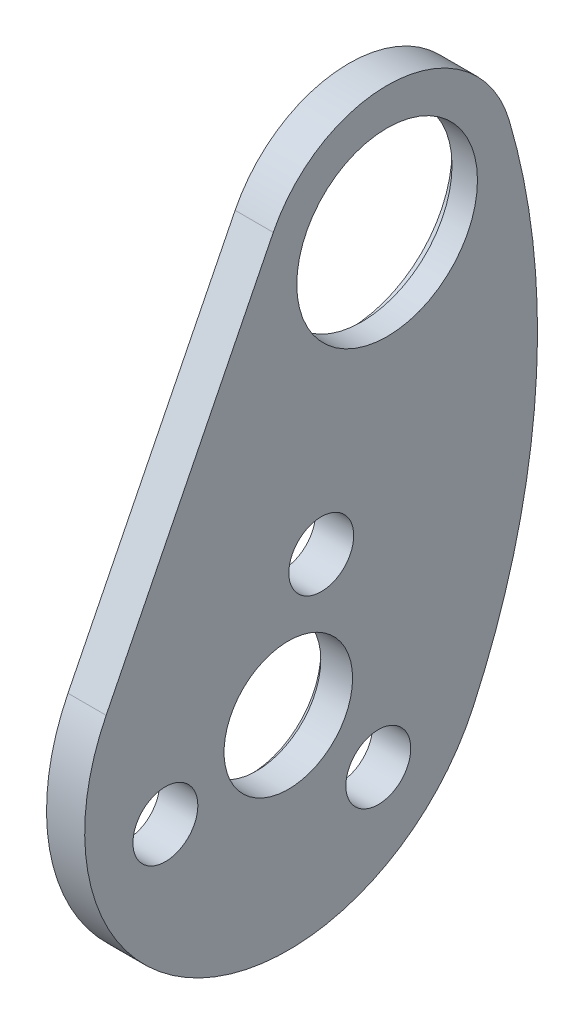
ISO-10303-21;
HEADER;
FILE_DESCRIPTION(('STEP AP214'),'2;1');
FILE_NAME('part.step','',(''),(''),'','','');
FILE_SCHEMA(('AUTOMOTIVE_DESIGN { 1 0 10303 214 1 1 1 1 }'));
ENDSEC;
DATA;
#1=APPLICATION_CONTEXT('core data for automotive mechanical design processes');
#2=APPLICATION_PROTOCOL_DEFINITION('international standard','automotive_design',2000,#1);
#3=PRODUCT_CONTEXT('',#1,'mechanical');
#4=PRODUCT('Part','Part','',(#3));
#5=PRODUCT_RELATED_PRODUCT_CATEGORY('part','',(#4));
#6=PRODUCT_DEFINITION_FORMATION('','',#4);
#7=PRODUCT_DEFINITION_CONTEXT('part definition',#1,'design');
#8=PRODUCT_DEFINITION('design','',#6,#7);
#9=PRODUCT_DEFINITION_SHAPE('','',#8);
#10=(LENGTH_UNIT() NAMED_UNIT(*) SI_UNIT(.MILLI.,.METRE.));
#11=(NAMED_UNIT(*) PLANE_ANGLE_UNIT() SI_UNIT($,.RADIAN.));
#12=(NAMED_UNIT(*) SI_UNIT($,.STERADIAN.) SOLID_ANGLE_UNIT());
#13=UNCERTAINTY_MEASURE_WITH_UNIT(LENGTH_MEASURE(1.E-05),#10,'distance_accuracy_value','');
#14=(GEOMETRIC_REPRESENTATION_CONTEXT(3) GLOBAL_UNCERTAINTY_ASSIGNED_CONTEXT((#13)) GLOBAL_UNIT_ASSIGNED_CONTEXT((#10,
#11,#12)) REPRESENTATION_CONTEXT('',''));
#15=CARTESIAN_POINT('',(0.,0.,0.));
#16=DIRECTION('',(0.,0.,1.));
#17=DIRECTION('',(1.,0.,0.));
#18=AXIS2_PLACEMENT_3D('',#15,#16,#17);
#19=CARTESIAN_POINT('',(10.,0.,0.));
#20=DIRECTION('',(-1.,0.,0.));
#21=DIRECTION('',(0.,0.,1.));
#22=AXIS2_PLACEMENT_3D('',#19,#20,#21);
#23=CYLINDRICAL_SURFACE('',#22,7.1);
#24=CARTESIAN_POINT('',(3.,0.,0.));
#25=DIRECTION('',(1.,0.,0.));
#26=DIRECTION('',(0.,0.,-1.));
#27=AXIS2_PLACEMENT_3D('',#24,#25,#26);
#28=CIRCLE('',#27,7.1);
#29=CARTESIAN_POINT('',(3.,0.,-7.1));
#30=VERTEX_POINT('',#29);
#31=EDGE_CURVE('E109',#30,#30,#28,.T.);
#32=ORIENTED_EDGE('',*,*,#31,.T.);
#33=EDGE_LOOP('',(#32));
#34=FACE_BOUND('',#33,.T.);
#35=CARTESIAN_POINT('',(0.999999999999999,0.,0.));
#36=DIRECTION('',(-1.,0.,0.));
#37=DIRECTION('',(0.,0.,1.));
#38=AXIS2_PLACEMENT_3D('',#35,#36,#37);
#39=CIRCLE('',#38,7.1);
#40=CARTESIAN_POINT('',(0.999999999999999,0.,7.1));
#41=VERTEX_POINT('',#40);
#42=EDGE_CURVE('E41',#41,#41,#39,.F.);
#43=ORIENTED_EDGE('',*,*,#42,.F.);
#44=EDGE_LOOP('',(#43));
#45=FACE_BOUND('',#44,.T.);
#46=ADVANCED_FACE('F37',(#34,#45),#23,.F.);
#47=CARTESIAN_POINT('',(3.,-12.6543120235321,43.1841219340059));
#48=DIRECTION('',(-1.,0.,0.));
#49=DIRECTION('',(0.,0.,1.));
#50=AXIS2_PLACEMENT_3D('',#47,#48,#49);
#51=CYLINDRICAL_SURFACE('',#50,55.);
#52=CARTESIAN_POINT('',(0.,-12.6543120235321,43.1841219340059));
#53=DIRECTION('',(1.,0.,0.));
#54=DIRECTION('',(0.,0.,-1.));
#55=AXIS2_PLACEMENT_3D('',#52,#53,#54);
#56=CIRCLE('',#55,55.);
#57=CARTESIAN_POINT('',(0.,-35.6745800256526,-6.76652632115234));
#58=VERTEX_POINT('',#57);
#59=CARTESIAN_POINT('',(0.,2.81206933856268,-9.59647154089021));
#60=VERTEX_POINT('',#59);
#61=EDGE_CURVE('E106',#58,#60,#56,.T.);
#62=ORIENTED_EDGE('',*,*,#61,.T.);
#63=DIRECTION('',(-1.,0.,0.));
#64=VECTOR('',#63,1.);
#65=CARTESIAN_POINT('',(3.,2.81206933856268,-9.59647154089021));
#66=LINE('',#65,#64);
#67=CARTESIAN_POINT('',(3.,2.81206933856268,-9.59647154089021));
#68=VERTEX_POINT('',#67);
#69=EDGE_CURVE('E97',#68,#60,#66,.T.);
#70=ORIENTED_EDGE('',*,*,#69,.F.);
#71=CARTESIAN_POINT('',(3.,-12.6543120235321,43.1841219340059));
#72=DIRECTION('',(1.,0.,0.));
#73=DIRECTION('',(0.,0.,-1.));
#74=AXIS2_PLACEMENT_3D('',#71,#72,#73);
#75=CIRCLE('',#74,55.);
#76=CARTESIAN_POINT('',(3.,-35.6745800256526,-6.76652632115234));
#77=VERTEX_POINT('',#76);
#78=EDGE_CURVE('E91',#77,#68,#75,.T.);
#79=ORIENTED_EDGE('',*,*,#78,.F.);
#80=DIRECTION('',(-1.,0.,0.));
#81=VECTOR('',#80,1.);
#82=CARTESIAN_POINT('',(3.,-35.6745800256526,-6.76652632115234));
#83=LINE('',#82,#81);
#84=EDGE_CURVE('E102',#77,#58,#83,.T.);
#85=ORIENTED_EDGE('',*,*,#84,.T.);
#86=EDGE_LOOP('',(#62,#70,#79,#85));
#87=FACE_BOUND('',#86,.T.);
#88=ADVANCED_FACE('F138',(#87),#51,.T.);
#89=CARTESIAN_POINT('',(3.,0.,0.));
#90=DIRECTION('',(-1.,0.,0.));
#91=DIRECTION('',(0.,0.,1.));
#92=AXIS2_PLACEMENT_3D('',#89,#90,#91);
#93=CYLINDRICAL_SURFACE('',#92,10.);
#94=CARTESIAN_POINT('',(0.,0.,0.));
#95=DIRECTION('',(1.,0.,0.));
#96=DIRECTION('',(0.,0.,-1.));
#97=AXIS2_PLACEMENT_3D('',#94,#95,#96);
#98=CIRCLE('',#97,10.);
#99=CARTESIAN_POINT('',(0.,4.46775003744035,8.94646352493273));
#100=VERTEX_POINT('',#99);
#101=EDGE_CURVE('E96',#60,#100,#98,.T.);
#102=ORIENTED_EDGE('',*,*,#101,.T.);
#103=DIRECTION('',(-1.,0.,0.));
#104=VECTOR('',#103,1.);
#105=CARTESIAN_POINT('',(3.,4.46775003744035,8.94646352493273));
#106=LINE('',#105,#104);
#107=CARTESIAN_POINT('',(3.,4.46775003744035,8.94646352493273));
#108=VERTEX_POINT('',#107);
#109=EDGE_CURVE('E94',#108,#100,#106,.T.);
#110=ORIENTED_EDGE('',*,*,#109,.F.);
#111=CARTESIAN_POINT('',(3.,0.,0.));
#112=DIRECTION('',(1.,0.,0.));
#113=DIRECTION('',(0.,0.,-1.));
#114=AXIS2_PLACEMENT_3D('',#111,#112,#113);
#115=CIRCLE('',#114,10.);
#116=EDGE_CURVE('E86',#68,#108,#115,.T.);
#117=ORIENTED_EDGE('',*,*,#116,.F.);
#118=ORIENTED_EDGE('',*,*,#69,.T.);
#119=EDGE_LOOP('',(#102,#110,#117,#118));
#120=FACE_BOUND('',#119,.T.);
#121=ADVANCED_FACE('F95',(#120),#93,.T.);
#122=CARTESIAN_POINT('',(3.,4.46775003744035,8.94646352493273));
#123=DIRECTION('',(0.,-0.446775003744035,-0.894646352493273));
#124=DIRECTION('',(0.,0.894646352493273,-0.446775003744035));
#125=AXIS2_PLACEMENT_3D('',#122,#123,#124);
#126=PLANE('',#125);
#127=DIRECTION('',(0.,-0.894646352493273,0.446775003744035));
#128=VECTOR('',#127,1.);
#129=CARTESIAN_POINT('',(0.,4.46775003744035,8.94646352493273));
#130=LINE('',#129,#128);
#131=CARTESIAN_POINT('',(0.,-21.8293747287675,22.0789129929679));
#132=VERTEX_POINT('',#131);
#133=EDGE_CURVE('E72',#100,#132,#130,.T.);
#134=ORIENTED_EDGE('',*,*,#133,.T.);
#135=DIRECTION('',(-1.,0.,0.));
#136=VECTOR('',#135,1.);
#137=CARTESIAN_POINT('',(3.,-21.8293747287675,22.0789129929679));
#138=LINE('',#137,#136);
#139=CARTESIAN_POINT('',(3.,-21.8293747287675,22.0789129929679));
#140=VERTEX_POINT('',#139);
#141=EDGE_CURVE('E98',#140,#132,#138,.T.);
#142=ORIENTED_EDGE('',*,*,#141,.F.);
#143=DIRECTION('',(0.,-0.894646352493273,0.446775003744035));
#144=VECTOR('',#143,1.);
#145=CARTESIAN_POINT('',(3.,4.46775003744035,8.94646352493273));
#146=LINE('',#145,#144);
#147=EDGE_CURVE('E89',#108,#140,#146,.T.);
#148=ORIENTED_EDGE('',*,*,#147,.F.);
#149=ORIENTED_EDGE('',*,*,#109,.T.);
#150=EDGE_LOOP('',(#134,#142,#148,#149));
#151=FACE_BOUND('',#150,.T.);
#152=ADVANCED_FACE('F100',(#151),#126,.F.);
#153=CARTESIAN_POINT('',(3.,-28.9777747886721,7.76457135307553));
#154=DIRECTION('',(-1.,0.,0.));
#155=DIRECTION('',(0.,0.,1.));
#156=AXIS2_PLACEMENT_3D('',#153,#154,#155);
#157=CYLINDRICAL_SURFACE('',#156,16.);
#158=CARTESIAN_POINT('',(0.,-28.9777747886721,7.76457135307553));
#159=DIRECTION('',(1.,0.,0.));
#160=DIRECTION('',(0.,0.,-1.));
#161=AXIS2_PLACEMENT_3D('',#158,#159,#160);
#162=CIRCLE('',#161,16.);
#163=EDGE_CURVE('E78',#132,#58,#162,.T.);
#164=ORIENTED_EDGE('',*,*,#163,.T.);
#165=ORIENTED_EDGE('',*,*,#84,.F.);
#166=CARTESIAN_POINT('',(3.,-28.9777747886721,7.76457135307553));
#167=DIRECTION('',(1.,0.,0.));
#168=DIRECTION('',(0.,0.,-1.));
#169=AXIS2_PLACEMENT_3D('',#166,#167,#168);
#170=CIRCLE('',#169,16.);
#171=EDGE_CURVE('E55',#140,#77,#170,.T.);
#172=ORIENTED_EDGE('',*,*,#171,.F.);
#173=ORIENTED_EDGE('',*,*,#141,.T.);
#174=EDGE_LOOP('',(#164,#165,#172,#173));
#175=FACE_BOUND('',#174,.T.);
#176=ADVANCED_FACE('F156',(#175),#157,.T.);
#177=CARTESIAN_POINT('',(3.,0.,0.));
#178=DIRECTION('',(1.,0.,0.));
#179=DIRECTION('',(0.,0.,-1.));
#180=AXIS2_PLACEMENT_3D('',#177,#178,#179);
#181=PLANE('',#180);
#182=CARTESIAN_POINT('',(3.,-36.0488426005375,0.693503541210037));
#183=DIRECTION('',(1.,0.,0.));
#184=DIRECTION('',(0.,0.,-1.));
#185=AXIS2_PLACEMENT_3D('',#182,#183,#184);
#186=CIRCLE('',#185,2.55);
#187=CARTESIAN_POINT('',(3.,-36.0488426005375,-1.85649645878996));
#188=VERTEX_POINT('',#187);
#189=EDGE_CURVE('E254',#188,#188,#186,.T.);
#190=ORIENTED_EDGE('',*,*,#189,.F.);
#191=EDGE_LOOP('',(#190));
#192=FACE_BOUND('',#191,.T.);
#193=CARTESIAN_POINT('',(3.,-31.5659652396973,17.4238296159662));
#194=DIRECTION('',(1.,0.,0.));
#195=DIRECTION('',(0.,0.,-1.));
#196=AXIS2_PLACEMENT_3D('',#193,#194,#195);
#197=CIRCLE('',#196,2.55);
#198=CARTESIAN_POINT('',(3.,-31.5659652396973,14.8738296159662));
#199=VERTEX_POINT('',#198);
#200=EDGE_CURVE('E248',#199,#199,#197,.T.);
#201=ORIENTED_EDGE('',*,*,#200,.F.);
#202=EDGE_LOOP('',(#201));
#203=FACE_BOUND('',#202,.T.);
#204=CARTESIAN_POINT('',(3.,-19.3185165257814,5.17638090205038));
#205=DIRECTION('',(1.,0.,0.));
#206=DIRECTION('',(0.,0.,-1.));
#207=AXIS2_PLACEMENT_3D('',#204,#205,#206);
#208=CIRCLE('',#207,2.55);
#209=CARTESIAN_POINT('',(3.,-19.3185165257814,2.62638090205038));
#210=VERTEX_POINT('',#209);
#211=EDGE_CURVE('E260',#210,#210,#208,.T.);
#212=ORIENTED_EDGE('',*,*,#211,.F.);
#213=EDGE_LOOP('',(#212));
#214=FACE_BOUND('',#213,.T.);
#215=ORIENTED_EDGE('',*,*,#31,.F.);
#216=EDGE_LOOP('',(#215));
#217=FACE_BOUND('',#216,.T.);
#218=CARTESIAN_POINT('',(3.,-28.9777747886721,7.76457135307553));
#219=DIRECTION('',(1.,0.,0.));
#220=DIRECTION('',(0.,0.,-1.));
#221=AXIS2_PLACEMENT_3D('',#218,#219,#220);
#222=CIRCLE('',#221,5.05);
#223=CARTESIAN_POINT('',(3.,-28.9777747886721,2.71457135307552));
#224=VERTEX_POINT('',#223);
#225=EDGE_CURVE('E263',#224,#224,#222,.T.);
#226=ORIENTED_EDGE('',*,*,#225,.F.);
#227=EDGE_LOOP('',(#226));
#228=FACE_BOUND('',#227,.T.);
#229=ORIENTED_EDGE('',*,*,#78,.T.);
#230=ORIENTED_EDGE('',*,*,#116,.T.);
#231=ORIENTED_EDGE('',*,*,#147,.T.);
#232=ORIENTED_EDGE('',*,*,#171,.T.);
#233=EDGE_LOOP('',(#229,#230,#231,#232));
#234=FACE_BOUND('',#233,.T.);
#235=ADVANCED_FACE('F87',(#192,#203,#214,#217,#228,#234),#181,.T.);
#236=CARTESIAN_POINT('',(0.,0.,0.));
#237=DIRECTION('',(1.,0.,0.));
#238=DIRECTION('',(0.,0.,-1.));
#239=AXIS2_PLACEMENT_3D('',#236,#237,#238);
#240=PLANE('',#239);
#241=CARTESIAN_POINT('',(0.,0.,0.));
#242=DIRECTION('',(-1.,0.,0.));
#243=DIRECTION('',(0.,0.,1.));
#244=AXIS2_PLACEMENT_3D('',#241,#242,#243);
#245=CIRCLE('',#244,8.1);
#246=CARTESIAN_POINT('',(0.,0.,8.1));
#247=VERTEX_POINT('',#246);
#248=EDGE_CURVE('E241',#247,#247,#245,.T.);
#249=ORIENTED_EDGE('',*,*,#248,.F.);
#250=EDGE_LOOP('',(#249));
#251=FACE_BOUND('',#250,.T.);
#252=CARTESIAN_POINT('',(0.,-28.9777747886721,7.76457135307553));
#253=DIRECTION('',(1.,0.,0.));
#254=DIRECTION('',(0.,0.,-1.));
#255=AXIS2_PLACEMENT_3D('',#252,#253,#254);
#256=CIRCLE('',#255,5.55);
#257=CARTESIAN_POINT('',(0.,-28.9777747886721,2.21457135307553));
#258=VERTEX_POINT('',#257);
#259=EDGE_CURVE('E11',#258,#258,#256,.T.);
#260=ORIENTED_EDGE('',*,*,#259,.T.);
#261=EDGE_LOOP('',(#260));
#262=FACE_BOUND('',#261,.T.);
#263=CARTESIAN_POINT('',(0.,-36.0488426005375,0.693503541210037));
#264=DIRECTION('',(-1.,0.,0.));
#265=DIRECTION('',(0.,0.866025403784436,-0.500000000000004));
#266=AXIS2_PLACEMENT_3D('',#263,#264,#265);
#267=CIRCLE('',#266,2.55);
#268=CARTESIAN_POINT('',(0.,-33.8404778208872,-0.581496458789974));
#269=VERTEX_POINT('',#268);
#270=EDGE_CURVE('E245',#269,#269,#267,.T.);
#271=ORIENTED_EDGE('',*,*,#270,.F.);
#272=EDGE_LOOP('',(#271));
#273=FACE_BOUND('',#272,.T.);
#274=CARTESIAN_POINT('',(0.,-31.5659652396973,17.4238296159662));
#275=DIRECTION('',(-1.,0.,0.));
#276=DIRECTION('',(0.,-0.866025403784443,-0.499999999999992));
#277=AXIS2_PLACEMENT_3D('',#274,#275,#276);
#278=CIRCLE('',#277,2.55);
#279=CARTESIAN_POINT('',(0.,-33.7743300193476,16.1488296159662));
#280=VERTEX_POINT('',#279);
#281=EDGE_CURVE('E249',#280,#280,#278,.T.);
#282=ORIENTED_EDGE('',*,*,#281,.F.);
#283=EDGE_LOOP('',(#282));
#284=FACE_BOUND('',#283,.T.);
#285=CARTESIAN_POINT('',(0.,-19.3185165257814,5.17638090205038));
#286=DIRECTION('',(-1.,0.,0.));
#287=DIRECTION('',(0.,0.,1.));
#288=AXIS2_PLACEMENT_3D('',#285,#286,#287);
#289=CIRCLE('',#288,2.55);
#290=CARTESIAN_POINT('',(0.,-19.3185165257814,7.72638090205038));
#291=VERTEX_POINT('',#290);
#292=EDGE_CURVE('E257',#291,#291,#289,.T.);
#293=ORIENTED_EDGE('',*,*,#292,.F.);
#294=EDGE_LOOP('',(#293));
#295=FACE_BOUND('',#294,.T.);
#296=ORIENTED_EDGE('',*,*,#61,.F.);
#297=ORIENTED_EDGE('',*,*,#163,.F.);
#298=ORIENTED_EDGE('',*,*,#133,.F.);
#299=ORIENTED_EDGE('',*,*,#101,.F.);
#300=EDGE_LOOP('',(#296,#297,#298,#299));
#301=FACE_BOUND('',#300,.T.);
#302=ADVANCED_FACE('F153',(#251,#262,#273,#284,#295,#301),#240,.F.);
#303=CARTESIAN_POINT('',(10.,-28.9777747886721,7.76457135307553));
#304=DIRECTION('',(-1.,0.,0.));
#305=DIRECTION('',(0.,0.,1.));
#306=AXIS2_PLACEMENT_3D('',#303,#304,#305);
#307=CYLINDRICAL_SURFACE('',#306,5.05);
#308=CARTESIAN_POINT('',(0.500000000000002,-28.9777747886721,7.76457135307553));
#309=DIRECTION('',(1.,0.,0.));
#310=DIRECTION('',(0.,0.,-1.));
#311=AXIS2_PLACEMENT_3D('',#308,#309,#310);
#312=CIRCLE('',#311,5.05);
#313=CARTESIAN_POINT('',(0.500000000000002,-28.9777747886721,2.71457135307552));
#314=VERTEX_POINT('',#313);
#315=EDGE_CURVE('E47',#314,#314,#312,.F.);
#316=ORIENTED_EDGE('',*,*,#315,.T.);
#317=EDGE_LOOP('',(#316));
#318=FACE_BOUND('',#317,.T.);
#319=ORIENTED_EDGE('',*,*,#225,.T.);
#320=EDGE_LOOP('',(#319));
#321=FACE_BOUND('',#320,.T.);
#322=ADVANCED_FACE('F119',(#318,#321),#307,.F.);
#323=CARTESIAN_POINT('',(10.,-19.3185165257814,5.17638090205038));
#324=DIRECTION('',(-1.,0.,0.));
#325=DIRECTION('',(0.,0.,1.));
#326=AXIS2_PLACEMENT_3D('',#323,#324,#325);
#327=CYLINDRICAL_SURFACE('',#326,2.55);
#328=ORIENTED_EDGE('',*,*,#211,.T.);
#329=EDGE_LOOP('',(#328));
#330=FACE_BOUND('',#329,.T.);
#331=ORIENTED_EDGE('',*,*,#292,.T.);
#332=EDGE_LOOP('',(#331));
#333=FACE_BOUND('',#332,.T.);
#334=ADVANCED_FACE('F149',(#330,#333),#327,.F.);
#335=CARTESIAN_POINT('',(10.,-31.5659652396973,17.4238296159662));
#336=DIRECTION('',(-1.,0.,0.));
#337=DIRECTION('',(0.,0.,1.));
#338=AXIS2_PLACEMENT_3D('',#335,#336,#337);
#339=CYLINDRICAL_SURFACE('',#338,2.55);
#340=ORIENTED_EDGE('',*,*,#200,.T.);
#341=EDGE_LOOP('',(#340));
#342=FACE_BOUND('',#341,.T.);
#343=ORIENTED_EDGE('',*,*,#281,.T.);
#344=EDGE_LOOP('',(#343));
#345=FACE_BOUND('',#344,.T.);
#346=ADVANCED_FACE('F133',(#342,#345),#339,.F.);
#347=CARTESIAN_POINT('',(10.,-36.0488426005375,0.693503541210037));
#348=DIRECTION('',(-1.,0.,0.));
#349=DIRECTION('',(0.,0.,1.));
#350=AXIS2_PLACEMENT_3D('',#347,#348,#349);
#351=CYLINDRICAL_SURFACE('',#350,2.55);
#352=ORIENTED_EDGE('',*,*,#189,.T.);
#353=EDGE_LOOP('',(#352));
#354=FACE_BOUND('',#353,.T.);
#355=ORIENTED_EDGE('',*,*,#270,.T.);
#356=EDGE_LOOP('',(#355));
#357=FACE_BOUND('',#356,.T.);
#358=ADVANCED_FACE('F124',(#354,#357),#351,.F.);
#359=CARTESIAN_POINT('',(0.500000000000002,-28.9777747886721,7.76457135307553));
#360=DIRECTION('',(-1.,0.,0.));
#361=DIRECTION('',(0.,0.,1.));
#362=AXIS2_PLACEMENT_3D('',#359,#360,#361);
#363=CONICAL_SURFACE('',#362,5.05,0.785398163397444);
#364=ORIENTED_EDGE('',*,*,#259,.F.);
#365=EDGE_LOOP('',(#364));
#366=FACE_BOUND('',#365,.T.);
#367=ORIENTED_EDGE('',*,*,#315,.F.);
#368=EDGE_LOOP('',(#367));
#369=FACE_BOUND('',#368,.T.);
#370=ADVANCED_FACE('F39',(#366,#369),#363,.F.);
#371=CARTESIAN_POINT('',(1.,0.,0.));
#372=DIRECTION('',(-1.,0.,0.));
#373=DIRECTION('',(0.,0.,1.));
#374=AXIS2_PLACEMENT_3D('',#371,#372,#373);
#375=PLANE('',#374);
#376=CARTESIAN_POINT('',(1.,0.,0.));
#377=DIRECTION('',(-1.,0.,0.));
#378=DIRECTION('',(0.,0.,1.));
#379=AXIS2_PLACEMENT_3D('',#376,#377,#378);
#380=CIRCLE('',#379,8.1);
#381=CARTESIAN_POINT('',(1.,0.,8.1));
#382=VERTEX_POINT('',#381);
#383=EDGE_CURVE('E238',#382,#382,#380,.T.);
#384=ORIENTED_EDGE('',*,*,#383,.T.);
#385=EDGE_LOOP('',(#384));
#386=FACE_BOUND('',#385,.T.);
#387=ORIENTED_EDGE('',*,*,#42,.T.);
#388=EDGE_LOOP('',(#387));
#389=FACE_BOUND('',#388,.T.);
#390=ADVANCED_FACE('F123',(#386,#389),#375,.T.);
#391=CARTESIAN_POINT('',(1.,0.,0.));
#392=DIRECTION('',(-1.,0.,0.));
#393=DIRECTION('',(0.,0.,1.));
#394=AXIS2_PLACEMENT_3D('',#391,#392,#393);
#395=CYLINDRICAL_SURFACE('',#394,8.1);
#396=ORIENTED_EDGE('',*,*,#383,.F.);
#397=EDGE_LOOP('',(#396));
#398=FACE_BOUND('',#397,.T.);
#399=ORIENTED_EDGE('',*,*,#248,.T.);
#400=EDGE_LOOP('',(#399));
#401=FACE_BOUND('',#400,.T.);
#402=ADVANCED_FACE('F130',(#398,#401),#395,.F.);
#403=CLOSED_SHELL('',(#46,#88,#121,#152,#176,#235,#302,#322,#334,#346,#358,#370,#390,#402));
#404=MANIFOLD_SOLID_BREP('B2',#403);
#405=ADVANCED_BREP_SHAPE_REPRESENTATION('',(#18,#404),#14);
#406=SHAPE_DEFINITION_REPRESENTATION(#9,#405);
ENDSEC;
END-ISO-10303-21;
